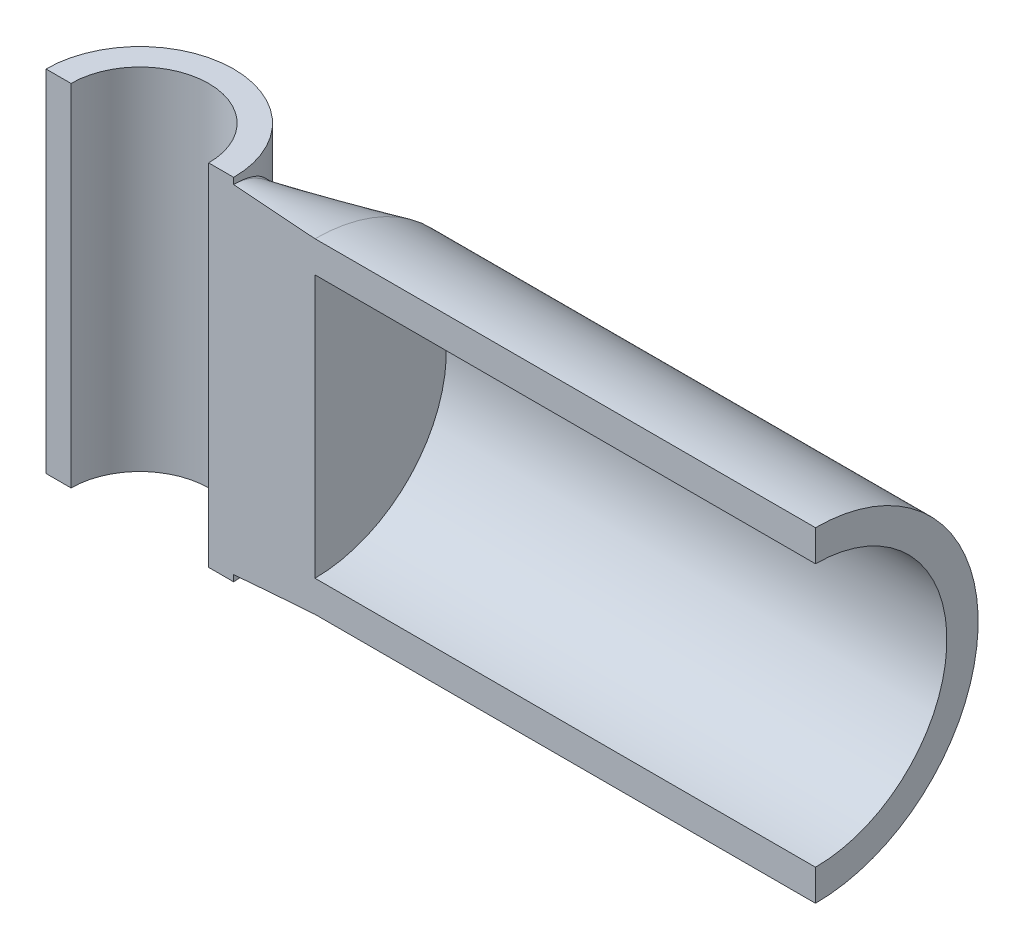
ISO-10303-21;
HEADER;
FILE_DESCRIPTION(('STEP AP214'),'2;1');
FILE_NAME('part.step','',(''),(''),'','','');
FILE_SCHEMA(('AUTOMOTIVE_DESIGN { 1 0 10303 214 1 1 1 1 }'));
ENDSEC;
DATA;
#1=APPLICATION_CONTEXT('core data for automotive mechanical design processes');
#2=APPLICATION_PROTOCOL_DEFINITION('international standard','automotive_design',2000,#1);
#3=PRODUCT_CONTEXT('',#1,'mechanical');
#4=PRODUCT('Part','Part','',(#3));
#5=PRODUCT_RELATED_PRODUCT_CATEGORY('part','',(#4));
#6=PRODUCT_DEFINITION_FORMATION('','',#4);
#7=PRODUCT_DEFINITION_CONTEXT('part definition',#1,'design');
#8=PRODUCT_DEFINITION('design','',#6,#7);
#9=PRODUCT_DEFINITION_SHAPE('','',#8);
#10=(LENGTH_UNIT() NAMED_UNIT(*) SI_UNIT(.MILLI.,.METRE.));
#11=(NAMED_UNIT(*) PLANE_ANGLE_UNIT() SI_UNIT($,.RADIAN.));
#12=(NAMED_UNIT(*) SI_UNIT($,.STERADIAN.) SOLID_ANGLE_UNIT());
#13=UNCERTAINTY_MEASURE_WITH_UNIT(LENGTH_MEASURE(1.E-05),#10,'distance_accuracy_value','');
#14=(GEOMETRIC_REPRESENTATION_CONTEXT(3) GLOBAL_UNCERTAINTY_ASSIGNED_CONTEXT((#13)) GLOBAL_UNIT_ASSIGNED_CONTEXT((#10,
#11,#12)) REPRESENTATION_CONTEXT('',''));
#15=CARTESIAN_POINT('',(0.,0.,0.));
#16=DIRECTION('',(0.,0.,1.));
#17=DIRECTION('',(1.,0.,0.));
#18=AXIS2_PLACEMENT_3D('',#15,#16,#17);
#19=CARTESIAN_POINT('',(0.,-17.78,0.));
#20=DIRECTION('',(0.,1.,0.));
#21=DIRECTION('',(0.,0.,1.));
#22=AXIS2_PLACEMENT_3D('',#19,#20,#21);
#23=CYLINDRICAL_SURFACE('',#22,9.525);
#24=DIRECTION('',(0.,1.,0.));
#25=VECTOR('',#24,1.);
#26=CARTESIAN_POINT('',(9.525,-17.78,0.));
#27=LINE('',#26,#25);
#28=CARTESIAN_POINT('',(9.525,-17.78,0.));
#29=VERTEX_POINT('',#28);
#30=CARTESIAN_POINT('',(9.525,-17.145,0.));
#31=VERTEX_POINT('',#30);
#32=EDGE_CURVE('E143',#29,#31,#27,.T.);
#33=ORIENTED_EDGE('',*,*,#32,.F.);
#34=CARTESIAN_POINT('',(0.,-17.78,0.));
#35=DIRECTION('',(0.,1.,0.));
#36=DIRECTION('',(0.,0.,1.));
#37=AXIS2_PLACEMENT_3D('',#34,#35,#36);
#38=CIRCLE('',#37,9.525);
#39=CARTESIAN_POINT('',(-9.52500000000001,-17.78,0.));
#40=VERTEX_POINT('',#39);
#41=EDGE_CURVE('E12',#29,#40,#38,.T.);
#42=ORIENTED_EDGE('',*,*,#41,.T.);
#43=DIRECTION('',(0.,1.,0.));
#44=VECTOR('',#43,1.);
#45=CARTESIAN_POINT('',(-9.52500000000001,43.1115148036341,0.));
#46=LINE('',#45,#44);
#47=CARTESIAN_POINT('',(-9.52500000000001,17.78,0.));
#48=VERTEX_POINT('',#47);
#49=EDGE_CURVE('E123',#40,#48,#46,.T.);
#50=ORIENTED_EDGE('',*,*,#49,.T.);
#51=CARTESIAN_POINT('',(0.,17.78,0.));
#52=DIRECTION('',(0.,1.,0.));
#53=DIRECTION('',(0.,0.,1.));
#54=AXIS2_PLACEMENT_3D('',#51,#52,#53);
#55=CIRCLE('',#54,9.525);
#56=CARTESIAN_POINT('',(9.525,17.78,0.));
#57=VERTEX_POINT('',#56);
#58=EDGE_CURVE('E332',#57,#48,#55,.T.);
#59=ORIENTED_EDGE('',*,*,#58,.F.);
#60=CARTESIAN_POINT('',(9.525,17.145,0.));
#61=VERTEX_POINT('',#60);
#62=EDGE_CURVE('E161',#61,#57,#27,.T.);
#63=ORIENTED_EDGE('',*,*,#62,.F.);
#64=CARTESIAN_POINT('',(9.525,-17.145,0.));
#65=CARTESIAN_POINT('',(9.52500068532762,-17.145001391133,0.128318924390924));
#66=CARTESIAN_POINT('',(9.5224009262164,-17.1396297825695,0.256628554292851));
#67=CARTESIAN_POINT('',(9.5120792277361,-17.1182992131656,0.512179138446968));
#68=CARTESIAN_POINT('',(9.50435632573581,-17.1023382626029,0.639419887306983));
#69=CARTESIAN_POINT('',(9.48410085409511,-17.0604636695596,0.890611239276342));
#70=CARTESIAN_POINT('',(9.47161420334114,-17.034645045696,1.0145815314022));
#71=CARTESIAN_POINT('',(9.44214149324302,-16.9736795479713,1.25969757564131));
#72=CARTESIAN_POINT('',(9.42515355723253,-16.9385287833618,1.3808421266787));
#73=CARTESIAN_POINT('',(9.3870311759982,-16.8596067877553,1.6198587262884));
#74=CARTESIAN_POINT('',(9.36588924392186,-16.8158199912686,1.73772442083015));
#75=CARTESIAN_POINT('',(9.31989459155717,-16.7205021081437,1.96956333119229));
#76=CARTESIAN_POINT('',(9.29503978212747,-16.6689666614307,2.08353431090623));
#77=CARTESIAN_POINT('',(9.19066169316927,-16.4523861308366,2.52416312253578));
#78=CARTESIAN_POINT('',(9.09849732371152,-16.2608266117642,2.83519485805657));
#79=CARTESIAN_POINT('',(8.94613047122778,-15.9431356332896,3.27360698917579));
#80=CARTESIAN_POINT('',(8.89290974054206,-15.8320157704412,3.41522080046828));
#81=CARTESIAN_POINT('',(8.7825587546782,-15.60121887365,3.68972912880236));
#82=CARTESIAN_POINT('',(8.72542917264761,-15.4815433129348,3.82262513946327));
#83=CARTESIAN_POINT('',(8.56516651194081,-15.1451751650685,4.17416065215533));
#84=CARTESIAN_POINT('',(8.45888795696625,-14.9214201350951,4.38459368894503));
#85=CARTESIAN_POINT('',(8.23997681272182,-14.4586413712805,4.78330768287632));
#86=CARTESIAN_POINT('',(8.12735180396737,-14.2196358100598,4.97161427254834));
#87=CARTESIAN_POINT('',(7.92424373363755,-13.7865002890836,5.28758772194248));
#88=CARTESIAN_POINT('',(7.83467091520297,-13.5947910791499,5.41920066085862));
#89=CARTESIAN_POINT('',(7.65357669807196,-13.2055325178248,5.67208807722901));
#90=CARTESIAN_POINT('',(7.56205500936725,-13.0079822955182,5.79336100237503));
#91=CARTESIAN_POINT('',(7.37759164622964,-12.60784198134,6.02651453904034));
#92=CARTESIAN_POINT('',(7.28464891776934,-12.4052480707042,6.13838773486383));
#93=CARTESIAN_POINT('',(7.09790498798253,-11.9958495483696,6.35339529022642));
#94=CARTESIAN_POINT('',(7.00410368316967,-11.7890444253036,6.45652858053565));
#95=CARTESIAN_POINT('',(6.72271525213335,-11.1645474627312,6.75314410303598));
#96=CARTESIAN_POINT('',(6.53450684035862,-10.7413982630866,6.93462935852449));
#97=CARTESIAN_POINT('',(6.15983672877069,-9.88370242338699,7.26945953927172));
#98=CARTESIAN_POINT('',(5.97337449486899,-9.44915943377956,7.42281335461494));
#99=CARTESIAN_POINT('',(5.60556999017795,-8.57012396264579,7.70433259890339));
#100=CARTESIAN_POINT('',(5.42422528330919,-8.12563640203105,7.83251019170726));
#101=CARTESIAN_POINT('',(5.15920212973809,-7.45176511512828,8.00746328472295));
#102=CARTESIAN_POINT('',(5.0720286654547,-7.22595666827723,8.06289435092908));
#103=CARTESIAN_POINT('',(4.90068086481704,-6.77191652771398,8.16817353221226));
#104=CARTESIAN_POINT('',(4.81650637947811,-6.54368495511213,8.2180219248924));
#105=CARTESIAN_POINT('',(4.65331817546855,-6.08860206670355,8.31149486964881));
#106=CARTESIAN_POINT('',(4.57424154002776,-5.86179190673089,8.35520986097442));
#107=CARTESIAN_POINT('',(4.42064071901423,-5.40572171638403,8.43748477527195));
#108=CARTESIAN_POINT('',(4.3461161849194,-5.17646187514761,8.47604509316996));
#109=CARTESIAN_POINT('',(4.20257824520052,-4.71507484729298,8.5481237132971));
#110=CARTESIAN_POINT('',(4.13357255795847,-4.48294415164354,8.58163501013761));
#111=CARTESIAN_POINT('',(4.00242661876834,-4.0159930322244,8.6435795719034));
#112=CARTESIAN_POINT('',(3.94028841962187,-3.78117182724394,8.67201132002796));
#113=CARTESIAN_POINT('',(3.81941641663787,-3.2888254737887,8.72596299724267));
#114=CARTESIAN_POINT('',(3.76142101745402,-3.03106717508945,8.75102995655326));
#115=CARTESIAN_POINT('',(3.65726262264106,-2.51261699890337,8.79507026682276));
#116=CARTESIAN_POINT('',(3.61110001457123,-2.25192502562178,8.81404341819639));
#117=CARTESIAN_POINT('',(3.5326394673394,-1.72809404489128,8.84578348388008));
#118=CARTESIAN_POINT('',(3.50033951409106,-1.46495539859572,8.85855129979062));
#119=CARTESIAN_POINT('',(3.45136274729835,-0.937695190567448,8.87774864178427));
#120=CARTESIAN_POINT('',(3.43464367626872,-0.673578249406205,8.88419531416838));
#121=CARTESIAN_POINT('',(3.41766410889622,-0.144695270853171,8.89074147948595));
#122=CARTESIAN_POINT('',(3.4174056379631,0.120070842408317,8.89084019132875));
#123=CARTESIAN_POINT('',(3.43336733820953,0.64891995214639,8.88468820112375));
#124=CARTESIAN_POINT('',(3.44958092856971,0.91300317920394,8.87844003474292));
#125=CARTESIAN_POINT('',(3.49480743974223,1.40982764820113,8.86072518835086));
#126=CARTESIAN_POINT('',(3.52217198030299,1.64274699896151,8.84992597937348));
#127=CARTESIAN_POINT('',(3.58794836012964,2.10668119173421,8.82346330355366));
#128=CARTESIAN_POINT('',(3.62635810617586,2.33769638608535,8.80780075833606));
#129=CARTESIAN_POINT('',(3.71290850872054,2.79778713627379,8.77166639925035));
#130=CARTESIAN_POINT('',(3.76106086356882,3.02686001205556,8.75118879890885));
#131=CARTESIAN_POINT('',(3.86564712000471,3.48262558328914,8.70549546050952));
#132=CARTESIAN_POINT('',(3.92208142858039,3.70931816118244,8.68027948958371));
#133=CARTESIAN_POINT('',(4.04164576414931,4.15935984530206,8.62525573132132));
#134=CARTESIAN_POINT('',(4.10474778928547,4.38271876551774,8.59546692664209));
#135=CARTESIAN_POINT('',(4.23665034230459,4.82705748807755,8.5312250251126));
#136=CARTESIAN_POINT('',(4.30545079358716,5.04803732235714,8.4967719909567));
#137=CARTESIAN_POINT('',(4.44768492938279,5.48755704831037,8.42319003673368));
#138=CARTESIAN_POINT('',(4.52111574574837,5.70609835360723,8.38406399805364));
#139=CARTESIAN_POINT('',(4.67179042200664,6.14095500311337,8.30104841371898));
#140=CARTESIAN_POINT('',(4.74903450462357,6.3572702164078,8.25715858964253));
#141=CARTESIAN_POINT('',(4.98522637552608,7.00260266356583,8.11827870367561));
#142=CARTESIAN_POINT('',(5.14876483467966,7.4284027395866,8.01601220322391));
#143=CARTESIAN_POINT('',(5.48352097620169,8.27156666635244,7.7908533456527));
#144=CARTESIAN_POINT('',(5.65474084411357,8.68892806646187,7.6679550906845));
#145=CARTESIAN_POINT('',(6.00153540489677,9.51485304871765,7.39968321307842));
#146=CARTESIAN_POINT('',(6.17711248123866,9.9234115766217,7.25429705102171));
#147=CARTESIAN_POINT('',(6.52959256103232,10.729981493898,6.93873458053696));
#148=CARTESIAN_POINT('',(6.7064945896787,11.1279998152068,6.76857506861832));
#149=CARTESIAN_POINT('',(7.02080010398045,11.8264573623029,6.44001881942489));
#150=CARTESIAN_POINT('',(7.15845225121188,12.1293443241387,6.28706950901455));
#151=CARTESIAN_POINT('',(7.43179718456903,12.7261392115118,5.9614863931751));
#152=CARTESIAN_POINT('',(7.56748632110351,13.0200313239349,5.78882019225024));
#153=CARTESIAN_POINT('',(7.80473711640115,13.5306879180504,5.46284147415894));
#154=CARTESIAN_POINT('',(7.90709386256605,13.749898489035,5.31394662006122));
#155=CARTESIAN_POINT('',(8.10839487006017,14.1792371594905,5.00141186388438));
#156=CARTESIAN_POINT('',(8.20733945831557,14.3893661295804,4.83777337988197));
#157=CARTESIAN_POINT('',(8.40023989721174,14.7976106817961,4.49447222936413));
#158=CARTESIAN_POINT('',(8.49420752403327,14.9957547956271,4.31485035665488));
#159=CARTESIAN_POINT('',(8.6757551288211,15.3774707136437,3.93711198806145));
#160=CARTESIAN_POINT('',(8.76332895070525,15.5610284884576,3.73897807607258));
#161=CARTESIAN_POINT('',(8.89160552736648,15.829270156124,3.41757581620205));
#162=CARTESIAN_POINT('',(8.93548199582827,15.9208935732083,3.30133503678769));
#163=CARTESIAN_POINT('',(9.02008180610424,16.0973519413748,3.06264395099305));
#164=CARTESIAN_POINT('',(9.06080464750314,16.1821858151683,2.94019266421478));
#165=CARTESIAN_POINT('',(9.1384236011794,16.3437192962771,2.68924702733705));
#166=CARTESIAN_POINT('',(9.17532767056684,16.4204358254046,2.56076608821909));
#167=CARTESIAN_POINT('',(9.24473317147388,16.5645940736278,2.29761415539768));
#168=CARTESIAN_POINT('',(9.27723704821432,16.6320409442638,2.1629466558064));
#169=CARTESIAN_POINT('',(9.33227760971739,16.746173253562,1.91001132046374));
#170=CARTESIAN_POINT('',(9.35557578301703,16.7944516492553,1.79262879199519));
#171=CARTESIAN_POINT('',(9.39814370021262,16.8826188413012,1.55408684479454));
#172=CARTESIAN_POINT('',(9.41741539544697,16.9225117015645,1.432929288409));
#173=CARTESIAN_POINT('',(9.45150970845768,16.993062425965,1.18740760476302));
#174=CARTESIAN_POINT('',(9.46633505532803,17.0237259549523,1.06304549552043));
#175=CARTESIAN_POINT('',(9.49118260905065,17.0751063235551,0.811794232204127));
#176=CARTESIAN_POINT('',(9.50120474758437,17.0958230216918,0.684905042213164));
#177=CARTESIAN_POINT('',(9.51621459024575,17.1268461570292,0.428765599009137));
#178=CARTESIAN_POINT('',(9.52117118139144,17.1370882587189,0.299505660130364));
#179=CARTESIAN_POINT('',(9.52579461647629,17.1466420150261,0.0404853616133317));
#180=CARTESIAN_POINT('',(9.52546148409152,17.1459537185666,-0.089274995782525));
#181=CARTESIAN_POINT('',(9.5195150926699,17.1336660461635,-0.348180364393133));
#182=CARTESIAN_POINT('',(9.51390066448669,17.1220642542459,-0.477325232991475));
#183=CARTESIAN_POINT('',(9.49755565288517,17.0882799627324,-0.733884365959778));
#184=CARTESIAN_POINT('',(9.4868251462493,17.06609762193,-0.861298656272853));
#185=CARTESIAN_POINT('',(9.46172434607469,17.0141894175261,-1.10214228125246));
#186=CARTESIAN_POINT('',(9.44776675165013,16.9853184231682,-1.2158010842582));
#187=CARTESIAN_POINT('',(9.41614674550098,16.9198850739686,-1.44037428269834));
#188=CARTESIAN_POINT('',(9.39848317278917,16.883320308857,-1.55128780590563));
#189=CARTESIAN_POINT('',(9.34042885280883,16.7630821824071,-1.87915265871484));
#190=CARTESIAN_POINT('',(9.29495967787159,16.6688343724019,-2.09136458695062));
#191=CARTESIAN_POINT('',(9.16076373245886,16.3902658450272,-2.6316645253732));
#192=CARTESIAN_POINT('',(9.06292060689757,16.1867885243535,-2.94757518485465));
#193=CARTESIAN_POINT('',(8.90185432825655,15.8506965851272,-3.39229038027132));
#194=CARTESIAN_POINT('',(8.84565141183374,15.7332460833386,-3.5359357996142));
#195=CARTESIAN_POINT('',(8.72933348979714,15.4897234375088,-3.81405778731643));
#196=CARTESIAN_POINT('',(8.66921925783922,15.3636529982367,-3.94853615820166));
#197=CARTESIAN_POINT('',(8.49858348055318,15.0050567378641,-4.30866397905967));
#198=CARTESIAN_POINT('',(8.38473389998818,14.7649827613238,-4.52521258264479));
#199=CARTESIAN_POINT('',(8.15037095834782,14.2685435195765,-4.93485122667267));
#200=CARTESIAN_POINT('',(8.02985199053893,14.0121645194058,-5.12792107963171));
#201=CARTESIAN_POINT('',(7.78431171729574,13.4869698072339,-5.49350661225298));
#202=CARTESIAN_POINT('',(7.65928707737101,13.2181448407125,-5.6660066445241));
#203=CARTESIAN_POINT('',(7.4065172139052,12.6710398908665,-5.99263997850955));
#204=CARTESIAN_POINT('',(7.27877304637783,12.3927635534635,-6.14678026147307));
#205=CARTESIAN_POINT('',(7.0070377804108,11.796039981134,-6.45554528552448));
#206=CARTESIAN_POINT('',(6.86286747141867,11.476652880018,-6.60818784675144));
#207=CARTESIAN_POINT('',(6.57445024703752,10.8304591049161,-6.89518183215504));
#208=CARTESIAN_POINT('',(6.43020370221977,10.5036631074982,-7.02955783962044));
#209=CARTESIAN_POINT('',(6.14288509298687,9.84331037887629,-7.28197380957341));
#210=CARTESIAN_POINT('',(5.99981311842168,9.50975313711106,-7.40001253307726));
#211=CARTESIAN_POINT('',(5.71639085798055,8.83656102104636,-7.62107479049304));
#212=CARTESIAN_POINT('',(5.57604064395353,8.49692598675939,-7.72409792849066));
#213=CARTESIAN_POINT('',(5.32930039438936,7.88491604250184,-7.89567556898984));
#214=CARTESIAN_POINT('',(5.22204709703272,7.6136317424831,-7.96689684623387));
#215=CARTESIAN_POINT('',(5.01140815812671,7.06753594738078,-8.10104930568151));
#216=CARTESIAN_POINT('',(4.90802243264331,6.79272452901675,-8.16398066786763));
#217=CARTESIAN_POINT('',(4.70614285273823,6.23877892194716,-8.28200139270145));
#218=CARTESIAN_POINT('',(4.60766267689167,5.95963521351296,-8.33706954851112));
#219=CARTESIAN_POINT('',(4.41748278537656,5.39753028511907,-8.43937969988608));
#220=CARTESIAN_POINT('',(4.3257848746463,5.11456807247692,-8.48661961627147));
#221=CARTESIAN_POINT('',(4.14953974847229,4.53928197293902,-8.57419443035667));
#222=CARTESIAN_POINT('',(4.06516310184918,4.24688257932757,-8.61437976866151));
#223=CARTESIAN_POINT('',(3.90817673322144,3.65791933358065,-8.68672863151387));
#224=CARTESIAN_POINT('',(3.83556718401748,3.36135542035841,-8.71889203826249));
#225=CARTESIAN_POINT('',(3.70514007807645,2.76414873233187,-8.77511362054172));
#226=CARTESIAN_POINT('',(3.64732406413697,2.46350553554472,-8.79917095078349));
#227=CARTESIAN_POINT('',(3.54994491308521,1.86035923829884,-8.83890771723432));
#228=CARTESIAN_POINT('',(3.51028398267441,1.55787521361515,-8.85463211332396));
#229=CARTESIAN_POINT('',(3.45146202437025,0.950607994761538,-8.87772792495739));
#230=CARTESIAN_POINT('',(3.43229782969967,0.645825163090767,-8.88510063086057));
#231=CARTESIAN_POINT('',(3.41598842825677,0.035822517433288,-8.89138595377053));
#232=CARTESIAN_POINT('',(3.41882348617108,-0.269396659362656,-8.89030615342999));
#233=CARTESIAN_POINT('',(3.44160527750243,-0.776511097816434,-8.88149960081635));
#234=CARTESIAN_POINT('',(3.4554978201446,-0.978747399692027,-8.87612215957019));
#235=CARTESIAN_POINT('',(3.49236414300072,-1.38222567224812,-8.86168249993286));
#236=CARTESIAN_POINT('',(3.51533640764344,-1.5834678032007,-8.85262089648834));
#237=CARTESIAN_POINT('',(3.56968842016194,-1.98489847510913,-8.83084378592175));
#238=CARTESIAN_POINT('',(3.60108024461458,-2.18508507818492,-8.81812302838514));
#239=CARTESIAN_POINT('',(3.67138820401819,-2.58386977587345,-8.78908295846825));
#240=CARTESIAN_POINT('',(3.71030487477605,-2.782467756319,-8.7727633898229));
#241=CARTESIAN_POINT('',(3.81750022291542,-3.28450444793394,-8.72681541256209));
#242=CARTESIAN_POINT('',(3.89029929930663,-3.58675879203809,-8.69475458475053));
#243=CARTESIAN_POINT('',(4.04832340351057,-4.18699433297393,-8.62231126312558));
#244=CARTESIAN_POINT('',(4.13355085619262,-4.48497468342753,-8.58192714473882));
#245=CARTESIAN_POINT('',(4.31368424385293,-5.07686628510665,-8.49281206756384));
#246=CARTESIAN_POINT('',(4.40859472017993,-5.37077555291603,-8.44407718490922));
#247=CARTESIAN_POINT('',(4.60578114849325,-5.95453290985261,-8.33816127418112));
#248=CARTESIAN_POINT('',(4.70805658930415,-6.24438127916717,-8.28098083199424));
#249=CARTESIAN_POINT('',(4.9179098293706,-6.81948450093699,-8.15809671414647));
#250=CARTESIAN_POINT('',(5.02547405171538,-7.10474885249849,-8.09241422149752));
#251=CARTESIAN_POINT('',(5.24470011737063,-7.67147880992567,-7.95208709630282));
#252=CARTESIAN_POINT('',(5.35636205923489,-7.95294432420295,-7.87744224810622));
#253=CARTESIAN_POINT('',(5.58249308308317,-8.51173112698692,-7.71883769879021));
#254=CARTESIAN_POINT('',(5.6969590628899,-8.78905649345315,-7.63488795885056));
#255=CARTESIAN_POINT('',(5.92782495202355,-9.33966915803567,-7.45706011310777));
#256=CARTESIAN_POINT('',(6.04422475760124,-9.61295667130499,-7.36318253848972));
#257=CARTESIAN_POINT('',(6.32549794444124,-10.2650819446248,-7.12461730903962));
#258=CARTESIAN_POINT('',(6.49090151993087,-10.6418185001755,-6.97475486826997));
#259=CARTESIAN_POINT('',(6.82192926509456,-11.3859258292458,-6.65136111844689));
#260=CARTESIAN_POINT('',(6.98755329668921,-11.7532785454484,-6.47778773783633));
#261=CARTESIAN_POINT('',(7.27867729702902,-12.3925330628166,-6.14680893705535));
#262=CARTESIAN_POINT('',(7.40467070997583,-12.6670094713756,-5.99482020245371));
#263=CARTESIAN_POINT('',(7.6540242942934,-13.20678669742,-5.67300756424842));
#264=CARTESIAN_POINT('',(7.77738351354982,-13.47208421804,-5.50317733896947));
#265=CARTESIAN_POINT('',(8.01954036339472,-13.9901705109664,-5.14387371794983));
#266=CARTESIAN_POINT('',(8.13834867773017,-14.2429890409664,-4.95445075544966));
#267=CARTESIAN_POINT('',(8.36958930766592,-14.7329810486803,-4.55294023471459));
#268=CARTESIAN_POINT('',(8.48202706813321,-14.9701679158524,-4.34087249211352));
#269=CARTESIAN_POINT('',(8.64187388651503,-15.3062210807961,-4.00725658027282));
#270=CARTESIAN_POINT('',(8.69285555026459,-15.4132144943236,-3.89557772613855));
#271=CARTESIAN_POINT('',(8.79220484026982,-15.6214032465473,-3.66584827328391));
#272=CARTESIAN_POINT('',(8.84057218118049,-15.7225979524053,-3.54779698183157));
#273=CARTESIAN_POINT('',(8.98111566426173,-16.0162528152347,-3.1832442623615));
#274=CARTESIAN_POINT('',(9.06868908418739,-16.1986909512834,-2.92643387132115));
#275=CARTESIAN_POINT('',(9.18719401624621,-16.4451027480404,-2.51824512447887));
#276=CARTESIAN_POINT('',(9.22478732412524,-16.5231834078362,-2.37719689957071));
#277=CARTESIAN_POINT('',(9.29452622181883,-16.6679104385617,-2.08794876250816));
#278=CARTESIAN_POINT('',(9.32667096126725,-16.7345550246665,-1.93974773863442));
#279=CARTESIAN_POINT('',(9.38446986090003,-16.8543106324185,-1.63736135884856));
#280=CARTESIAN_POINT('',(9.41014727363139,-16.9074701432253,-1.48319980906615));
#281=CARTESIAN_POINT('',(9.4542470875884,-16.99872843479,-1.1695582748093));
#282=CARTESIAN_POINT('',(9.47267580258039,-17.0368403224503,-1.0100830505952));
#283=CARTESIAN_POINT('',(9.49959704582709,-17.0925013278238,-0.709172058197316));
#284=CARTESIAN_POINT('',(9.50909570650498,-17.1121330947042,-0.568210482630604));
#285=CARTESIAN_POINT('',(9.52179561950566,-17.1383792118163,-0.284828409657496));
#286=CARTESIAN_POINT('',(9.52499923942267,-17.1449984561191,-0.142408481010841));
#287=CARTESIAN_POINT('',(9.525,-17.145,0.));
#288=B_SPLINE_CURVE_WITH_KNOTS('',3,(#64,#65,#66,#67,#68,#69,#70,#71,#72,#73,#74,#75,#76,#77,
#78,#79,#80,#81,#82,#83,#84,#85,#86,#87,#88,#89,#90,#91,#92,#93,#94,#95,#96,#97,#98,#99,#100,
#101,#102,#103,#104,#105,#106,#107,#108,#109,#110,#111,#112,#113,#114,#115,#116,#117,#118,#119,
#120,#121,#122,#123,#124,#125,#126,#127,#128,#129,#130,#131,#132,#133,#134,#135,#136,#137,#138,
#139,#140,#141,#142,#143,#144,#145,#146,#147,#148,#149,#150,#151,#152,#153,#154,#155,#156,#157,
#158,#159,#160,#161,#162,#163,#164,#165,#166,#167,#168,#169,#170,#171,#172,#173,#174,#175,#176,
#177,#178,#179,#180,#181,#182,#183,#184,#185,#186,#187,#188,#189,#190,#191,#192,#193,#194,#195,
#196,#197,#198,#199,#200,#201,#202,#203,#204,#205,#206,#207,#208,#209,#210,#211,#212,#213,#214,
#215,#216,#217,#218,#219,#220,#221,#222,#223,#224,#225,#226,#227,#228,#229,#230,#231,#232,#233,
#234,#235,#236,#237,#238,#239,#240,#241,#242,#243,#244,#245,#246,#247,#248,#249,#250,#251,#252,
#253,#254,#255,#256,#257,#258,#259,#260,#261,#262,#263,#264,#265,#266,#267,#268,#269,#270,#271,
#272,#273,#274,#275,#276,#277,#278,#279,#280,#281,#282,#283,#284,#285,#286,#287),.UNSPECIFIED.,
.T.,.F.,(4,2,2,2,2,2,2,2,2,2,2,2,2,2,2,2,2,2,2,2,2,2,2,2,2,2,2,2,2,2,2,2,2,2,2,2,2,2,2,2,2,2,2,
2,2,2,2,2,2,2,2,2,2,2,2,2,2,2,2,2,2,2,2,2,2,2,2,2,2,2,2,2,2,2,2,2,2,2,2,2,2,2,2,2,2,2,2,2,2,2,2,
2,2,2,2,2,2,2,2,2,2,2,2,2,2,2,2,2,2,2,2,4),(0.,0.384804366523112,0.769681057724254,
1.15093791835735,1.53235398258471,1.91446389504051,2.29678962653608,3.41965514839574,
3.98255305269532,4.54535426253948,5.5188908189974,6.49128821816948,7.23856666539762,
7.98595710197965,8.73393174401188,9.48199776068552,10.973017463361,12.4635651598891,
13.9533909191829,14.6982693355021,15.4431106956624,16.175447244597,16.9077276532589,
17.641014906795,18.3745207621016,19.1703789507176,19.9662632027377,20.7620317826363,
21.5556357940439,22.3493374550021,23.1427221456693,23.8466942045373,24.5505329387588,
25.2552218707341,25.9599454438215,26.6618189720333,27.3636830669296,28.0651166033726,
28.7665911575455,30.1682748441499,31.570359904248,32.9732296143875,34.3751525604545,
35.473144982202,36.572968127907,37.4247473411366,38.2764447155348,39.1260274830549,
39.9764177436499,40.4392946186258,40.9022447927115,41.3642100319537,41.8259174904072,
42.2126956257277,42.5992858810493,42.9856383658585,43.3719963457982,43.7607133577163,
44.1494286297919,44.5382299739307,44.9270254830983,45.2809550058639,45.6349955715999,
46.3426594298867,47.5005612666438,48.0819109922545,48.6631460747726,49.6897686284852,
50.717267742871,51.7455435524302,52.7734271059217,53.9194992563613,55.0640134109518,
56.2086143154772,57.3532453941128,58.2539501436169,59.154635334676,60.0577055351162,
60.9610152078402,61.8816237113883,62.8022457329126,63.7229637257543,64.63866211275,
65.554219002489,66.4689546501528,67.0770799173442,67.6851037201735,68.2940043482681,
68.9029483491264,69.8400944204212,70.7774235811801,71.715194389065,72.6529001723045,
73.588313064642,74.5237484692552,75.4581919603376,76.3925854796412,77.7055944196891,
79.0209641161971,80.0347657332102,81.0489277842119,82.0605413723215,83.0712768776845,
83.5595833550071,84.0479430222455,85.0250697294623,85.5211971419875,86.0174019146992,
86.511796318807,87.0057591364307,87.4329761474894,87.8600324494574),.UNSPECIFIED.);
#289=EDGE_CURVE('E145',#61,#31,#288,.T.);
#290=ORIENTED_EDGE('',*,*,#289,.T.);
#291=EDGE_LOOP('',(#33,#42,#50,#59,#63,#290));
#292=FACE_BOUND('',#291,.T.);
#293=ADVANCED_FACE('F41',(#292),#23,.T.);
#294=CARTESIAN_POINT('',(0.,-17.78,0.));
#295=DIRECTION('',(0.,1.,0.));
#296=DIRECTION('',(0.,0.,1.));
#297=AXIS2_PLACEMENT_3D('',#294,#295,#296);
#298=PLANE('',#297);
#299=ORIENTED_EDGE('',*,*,#41,.F.);
#300=DIRECTION('',(-1.,0.,0.));
#301=VECTOR('',#300,1.);
#302=CARTESIAN_POINT('',(0.,-17.78,0.));
#303=LINE('',#302,#301);
#304=CARTESIAN_POINT('',(6.985,-17.78,0.));
#305=VERTEX_POINT('',#304);
#306=EDGE_CURVE('E140',#29,#305,#303,.T.);
#307=ORIENTED_EDGE('',*,*,#306,.T.);
#308=CARTESIAN_POINT('',(0.,-17.78,0.));
#309=DIRECTION('',(0.,1.,0.));
#310=DIRECTION('',(0.,0.,1.));
#311=AXIS2_PLACEMENT_3D('',#308,#309,#310);
#312=CIRCLE('',#311,6.985);
#313=CARTESIAN_POINT('',(-6.985,-17.78,0.));
#314=VERTEX_POINT('',#313);
#315=EDGE_CURVE('E50',#305,#314,#312,.T.);
#316=ORIENTED_EDGE('',*,*,#315,.T.);
#317=EDGE_CURVE('E126',#314,#40,#303,.T.);
#318=ORIENTED_EDGE('',*,*,#317,.T.);
#319=EDGE_LOOP('',(#299,#307,#316,#318));
#320=FACE_BOUND('',#319,.T.);
#321=ADVANCED_FACE('F136',(#320),#298,.F.);
#322=CARTESIAN_POINT('',(0.,-17.78,0.));
#323=DIRECTION('',(0.,1.,0.));
#324=DIRECTION('',(0.,0.,1.));
#325=AXIS2_PLACEMENT_3D('',#322,#323,#324);
#326=CYLINDRICAL_SURFACE('',#325,6.985);
#327=CARTESIAN_POINT('',(0.,17.78,0.));
#328=DIRECTION('',(0.,1.,0.));
#329=DIRECTION('',(0.,0.,1.));
#330=AXIS2_PLACEMENT_3D('',#327,#328,#329);
#331=CIRCLE('',#330,6.985);
#332=CARTESIAN_POINT('',(6.985,17.78,0.));
#333=VERTEX_POINT('',#332);
#334=CARTESIAN_POINT('',(-6.985,17.78,0.));
#335=VERTEX_POINT('',#334);
#336=EDGE_CURVE('E239',#333,#335,#331,.T.);
#337=ORIENTED_EDGE('',*,*,#336,.T.);
#338=DIRECTION('',(0.,1.,0.));
#339=VECTOR('',#338,1.);
#340=CARTESIAN_POINT('',(-6.985,-17.78,0.));
#341=LINE('',#340,#339);
#342=EDGE_CURVE('E58',#335,#314,#341,.F.);
#343=ORIENTED_EDGE('',*,*,#342,.T.);
#344=ORIENTED_EDGE('',*,*,#315,.F.);
#345=DIRECTION('',(0.,1.,0.));
#346=VECTOR('',#345,1.);
#347=CARTESIAN_POINT('',(6.985,-17.78,0.));
#348=LINE('',#347,#346);
#349=EDGE_CURVE('E330',#305,#333,#348,.T.);
#350=ORIENTED_EDGE('',*,*,#349,.T.);
#351=EDGE_LOOP('',(#337,#343,#344,#350));
#352=FACE_BOUND('',#351,.T.);
#353=ADVANCED_FACE('F318',(#352),#326,.F.);
#354=CARTESIAN_POINT('',(0.,17.78,0.));
#355=DIRECTION('',(0.,1.,0.));
#356=DIRECTION('',(0.,0.,1.));
#357=AXIS2_PLACEMENT_3D('',#354,#355,#356);
#358=PLANE('',#357);
#359=DIRECTION('',(-1.,0.,0.));
#360=VECTOR('',#359,1.);
#361=CARTESIAN_POINT('',(0.,17.78,0.));
#362=LINE('',#361,#360);
#363=EDGE_CURVE('E165',#57,#333,#362,.T.);
#364=ORIENTED_EDGE('',*,*,#363,.F.);
#365=ORIENTED_EDGE('',*,*,#58,.T.);
#366=EDGE_CURVE('E127',#335,#48,#362,.T.);
#367=ORIENTED_EDGE('',*,*,#366,.F.);
#368=ORIENTED_EDGE('',*,*,#336,.F.);
#369=EDGE_LOOP('',(#364,#365,#367,#368));
#370=FACE_BOUND('',#369,.T.);
#371=ADVANCED_FACE('F248',(#370),#358,.T.);
#372=CARTESIAN_POINT('',(-9.526,0.,0.));
#373=DIRECTION('',(1.,0.,0.));
#374=DIRECTION('',(0.,-1.,0.));
#375=AXIS2_PLACEMENT_3D('',#372,#373,#374);
#376=ELLIPSE('',#375,17.145,8.89);
#377=DIRECTION('',(1.,0.,0.));
#378=VECTOR('',#377,1.);
#379=SURFACE_OF_LINEAR_EXTRUSION('',#376,#378);
#380=ORIENTED_EDGE('',*,*,#289,.F.);
#381=CARTESIAN_POINT('',(9.525,12.8035000905406,-5.91250754467299));
#382=CARTESIAN_POINT('',(9.525,35.6088863342793,7.36519625292469));
#383=CARTESIAN_POINT('',(9.525,10.0018861531981,19.1902113422707));
#384=CARTESIAN_POINT('',(9.525,-12.8035000905406,5.91250754467299));
#385=CARTESIAN_POINT('',(9.525,-35.6088863342793,-7.36519625292468));
#386=CARTESIAN_POINT('',(9.525,-10.0018861531981,-19.1902113422707));
#387=CARTESIAN_POINT('',(9.525,12.8035000905406,-5.91250754467299));
#388=(BOUNDED_CURVE() B_SPLINE_CURVE(3,(#381,#382,#383,#384,#385,#386,#387),.UNSPECIFIED.,.T.,
.F.) B_SPLINE_CURVE_WITH_KNOTS((4,3,4),(0.,0.5,1.),
.UNSPECIFIED.) CURVE() GEOMETRIC_REPRESENTATION_ITEM() RATIONAL_B_SPLINE_CURVE((1.,
0.333333333333333,0.333333333333333,1.,0.333333333333333,0.333333333333333,1.)) REPRESENTATION_ITEM(''));
#389=CARTESIAN_POINT('',(9.525,16.8726077758818,-1.57838705019624));
#390=VERTEX_POINT('',#389);
#391=EDGE_CURVE('E66',#390,#61,#388,.T.);
#392=ORIENTED_EDGE('',*,*,#391,.F.);
#393=CARTESIAN_POINT('',(9.525,12.8035000905406,-5.91250754467299));
#394=CARTESIAN_POINT('',(9.525,35.6088863342793,7.36519625292469));
#395=CARTESIAN_POINT('',(9.525,10.0018861531981,19.1902113422707));
#396=CARTESIAN_POINT('',(9.525,-12.8035000905406,5.91250754467299));
#397=CARTESIAN_POINT('',(9.525,-35.6088863342793,-7.36519625292468));
#398=CARTESIAN_POINT('',(9.525,-10.0018861531981,-19.1902113422707));
#399=CARTESIAN_POINT('',(9.525,12.8035000905406,-5.91250754467299));
#400=(BOUNDED_CURVE() B_SPLINE_CURVE(3,(#393,#394,#395,#396,#397,#398,#399),.UNSPECIFIED.,.T.,
.F.) B_SPLINE_CURVE_WITH_KNOTS((4,3,4),(0.,0.5,1.),
.UNSPECIFIED.) CURVE() GEOMETRIC_REPRESENTATION_ITEM() RATIONAL_B_SPLINE_CURVE((1.,
0.333333333333333,0.333333333333333,1.,0.333333333333333,0.333333333333333,1.)) REPRESENTATION_ITEM(''));
#401=CARTESIAN_POINT('',(9.525,12.8035000905406,-5.91250754467299));
#402=VERTEX_POINT('',#401);
#403=EDGE_CURVE('E235',#402,#390,#400,.T.);
#404=ORIENTED_EDGE('',*,*,#403,.F.);
#405=CARTESIAN_POINT('',(9.525,12.8035000905406,-5.91250754467299));
#406=CARTESIAN_POINT('',(9.525,35.6088863342793,7.36519625292469));
#407=CARTESIAN_POINT('',(9.525,10.0018861531981,19.1902113422707));
#408=CARTESIAN_POINT('',(9.525,-12.8035000905406,5.91250754467299));
#409=CARTESIAN_POINT('',(9.525,-35.6088863342793,-7.36519625292468));
#410=CARTESIAN_POINT('',(9.525,-10.0018861531981,-19.1902113422707));
#411=CARTESIAN_POINT('',(9.525,12.8035000905406,-5.91250754467299));
#412=(BOUNDED_CURVE() B_SPLINE_CURVE(3,(#405,#406,#407,#408,#409,#410,#411),.UNSPECIFIED.,.T.,
.F.) B_SPLINE_CURVE_WITH_KNOTS((4,3,4),(0.,0.5,1.),
.UNSPECIFIED.) CURVE() GEOMETRIC_REPRESENTATION_ITEM() RATIONAL_B_SPLINE_CURVE((1.,
0.333333333333333,0.333333333333333,1.,0.333333333333333,0.333333333333333,1.)) REPRESENTATION_ITEM(''));
#413=CARTESIAN_POINT('',(9.525,-16.6007722013177,-2.22210367421809));
#414=VERTEX_POINT('',#413);
#415=EDGE_CURVE('E285',#414,#402,#412,.T.);
#416=ORIENTED_EDGE('',*,*,#415,.F.);
#417=CARTESIAN_POINT('',(9.525,12.8035000905406,-5.91250754467299));
#418=CARTESIAN_POINT('',(9.525,35.6088863342793,7.36519625292469));
#419=CARTESIAN_POINT('',(9.525,10.0018861531981,19.1902113422707));
#420=CARTESIAN_POINT('',(9.525,-12.8035000905406,5.91250754467299));
#421=CARTESIAN_POINT('',(9.525,-35.6088863342793,-7.36519625292468));
#422=CARTESIAN_POINT('',(9.525,-10.0018861531981,-19.1902113422707));
#423=CARTESIAN_POINT('',(9.525,12.8035000905406,-5.91250754467299));
#424=(BOUNDED_CURVE() B_SPLINE_CURVE(3,(#417,#418,#419,#420,#421,#422,#423),.UNSPECIFIED.,.T.,
.F.) B_SPLINE_CURVE_WITH_KNOTS((4,3,4),(0.,0.5,1.),
.UNSPECIFIED.) CURVE() GEOMETRIC_REPRESENTATION_ITEM() RATIONAL_B_SPLINE_CURVE((1.,
0.333333333333333,0.333333333333333,1.,0.333333333333333,0.333333333333333,1.)) REPRESENTATION_ITEM(''));
#425=EDGE_CURVE('E205',#31,#414,#424,.T.);
#426=ORIENTED_EDGE('',*,*,#425,.F.);
#427=EDGE_LOOP('',(#380,#392,#404,#416,#426));
#428=FACE_BOUND('',#427,.T.);
#429=ADVANCED_FACE('F242',(#428),#379,.T.);
#430=CARTESIAN_POINT('',(68.58,0.,0.));
#431=DIRECTION('',(1.,0.,0.));
#432=DIRECTION('',(0.,0.,-1.));
#433=AXIS2_PLACEMENT_3D('',#430,#431,#432);
#434=PLANE('',#433);
#435=DIRECTION('',(0.,1.,0.));
#436=VECTOR('',#435,1.);
#437=CARTESIAN_POINT('',(68.58,0.,0.));
#438=LINE('',#437,#436);
#439=CARTESIAN_POINT('',(68.58,-16.51,0.));
#440=VERTEX_POINT('',#439);
#441=CARTESIAN_POINT('',(68.58,-13.335,0.));
#442=VERTEX_POINT('',#441);
#443=EDGE_CURVE('E150',#440,#442,#438,.T.);
#444=ORIENTED_EDGE('',*,*,#443,.F.);
#445=CARTESIAN_POINT('',(68.58,0.,0.));
#446=DIRECTION('',(1.,0.,0.));
#447=DIRECTION('',(0.,0.,-1.));
#448=AXIS2_PLACEMENT_3D('',#445,#446,#447);
#449=CIRCLE('',#448,16.51);
#450=CARTESIAN_POINT('',(68.58,16.51,0.));
#451=VERTEX_POINT('',#450);
#452=EDGE_CURVE('E286',#440,#451,#449,.T.);
#453=ORIENTED_EDGE('',*,*,#452,.T.);
#454=CARTESIAN_POINT('',(68.58,13.335,0.));
#455=VERTEX_POINT('',#454);
#456=EDGE_CURVE('E155',#455,#451,#438,.T.);
#457=ORIENTED_EDGE('',*,*,#456,.F.);
#458=CARTESIAN_POINT('',(68.58,0.,0.));
#459=DIRECTION('',(1.,0.,0.));
#460=DIRECTION('',(0.,0.,-1.));
#461=AXIS2_PLACEMENT_3D('',#458,#459,#460);
#462=CIRCLE('',#461,13.335);
#463=EDGE_CURVE('E288',#442,#455,#462,.T.);
#464=ORIENTED_EDGE('',*,*,#463,.F.);
#465=EDGE_LOOP('',(#444,#453,#457,#464));
#466=FACE_BOUND('',#465,.T.);
#467=ADVANCED_FACE('F247',(#466),#434,.T.);
#468=CARTESIAN_POINT('',(68.58,0.,0.));
#469=DIRECTION('',(-1.,0.,0.));
#470=DIRECTION('',(0.,0.,1.));
#471=AXIS2_PLACEMENT_3D('',#468,#469,#470);
#472=CYLINDRICAL_SURFACE('',#471,16.51);
#473=ORIENTED_EDGE('',*,*,#452,.F.);
#474=DIRECTION('',(-1.,0.,0.));
#475=VECTOR('',#474,1.);
#476=CARTESIAN_POINT('',(68.58,-16.51,0.));
#477=LINE('',#476,#475);
#478=CARTESIAN_POINT('',(17.78,-16.51,0.));
#479=VERTEX_POINT('',#478);
#480=EDGE_CURVE('E153',#440,#479,#477,.T.);
#481=ORIENTED_EDGE('',*,*,#480,.T.);
#482=CARTESIAN_POINT('',(17.78,0.,0.));
#483=DIRECTION('',(1.,0.,0.));
#484=DIRECTION('',(0.,0.,-1.));
#485=AXIS2_PLACEMENT_3D('',#482,#483,#484);
#486=CIRCLE('',#485,16.51);
#487=CARTESIAN_POINT('',(17.78,16.51,0.));
#488=VERTEX_POINT('',#487);
#489=EDGE_CURVE('E44',#479,#488,#486,.T.);
#490=ORIENTED_EDGE('',*,*,#489,.T.);
#491=DIRECTION('',(-1.,0.,0.));
#492=VECTOR('',#491,1.);
#493=CARTESIAN_POINT('',(68.58,16.51,0.));
#494=LINE('',#493,#492);
#495=EDGE_CURVE('E334',#488,#451,#494,.F.);
#496=ORIENTED_EDGE('',*,*,#495,.T.);
#497=EDGE_LOOP('',(#473,#481,#490,#496));
#498=FACE_BOUND('',#497,.T.);
#499=ADVANCED_FACE('F296',(#498),#472,.T.);
#500=CARTESIAN_POINT('',(68.58,0.,0.));
#501=DIRECTION('',(-1.,0.,0.));
#502=DIRECTION('',(0.,0.,1.));
#503=AXIS2_PLACEMENT_3D('',#500,#501,#502);
#504=CYLINDRICAL_SURFACE('',#503,13.335);
#505=DIRECTION('',(-1.,0.,0.));
#506=VECTOR('',#505,1.);
#507=CARTESIAN_POINT('',(68.58,-13.335,0.));
#508=LINE('',#507,#506);
#509=CARTESIAN_POINT('',(17.78,-13.335,0.));
#510=VERTEX_POINT('',#509);
#511=EDGE_CURVE('E149',#442,#510,#508,.T.);
#512=ORIENTED_EDGE('',*,*,#511,.F.);
#513=ORIENTED_EDGE('',*,*,#463,.T.);
#514=DIRECTION('',(-1.,0.,0.));
#515=VECTOR('',#514,1.);
#516=CARTESIAN_POINT('',(68.58,13.335,0.));
#517=LINE('',#516,#515);
#518=CARTESIAN_POINT('',(17.78,13.335,0.));
#519=VERTEX_POINT('',#518);
#520=EDGE_CURVE('E339',#519,#455,#517,.F.);
#521=ORIENTED_EDGE('',*,*,#520,.F.);
#522=CARTESIAN_POINT('',(17.78,0.,0.));
#523=DIRECTION('',(1.,0.,0.));
#524=DIRECTION('',(0.,0.,-1.));
#525=AXIS2_PLACEMENT_3D('',#522,#523,#524);
#526=CIRCLE('',#525,13.335);
#527=EDGE_CURVE('E209',#510,#519,#526,.T.);
#528=ORIENTED_EDGE('',*,*,#527,.F.);
#529=EDGE_LOOP('',(#512,#513,#521,#528));
#530=FACE_BOUND('',#529,.T.);
#531=ADVANCED_FACE('F305',(#530),#504,.F.);
#532=CARTESIAN_POINT('',(17.78,0.,0.));
#533=DIRECTION('',(1.,0.,0.));
#534=DIRECTION('',(0.,0.,-1.));
#535=AXIS2_PLACEMENT_3D('',#532,#533,#534);
#536=PLANE('',#535);
#537=DIRECTION('',(0.,1.,0.));
#538=VECTOR('',#537,1.);
#539=CARTESIAN_POINT('',(17.78,0.,0.));
#540=LINE('',#539,#538);
#541=EDGE_CURVE('E341',#510,#519,#540,.T.);
#542=ORIENTED_EDGE('',*,*,#541,.F.);
#543=ORIENTED_EDGE('',*,*,#527,.T.);
#544=EDGE_LOOP('',(#542,#543));
#545=FACE_BOUND('',#544,.T.);
#546=ADVANCED_FACE('F185',(#545),#536,.T.);
#547=CARTESIAN_POINT('',(17.78,11.4820684931737,-11.8634819137582));
#548=CARTESIAN_POINT('',(9.525,12.8035000905406,-5.91250754467299));
#549=CARTESIAN_POINT('',(17.78,-12.2448953343427,-34.8276189001056));
#550=CARTESIAN_POINT('',(9.525,-10.0018861531981,-19.1902113422707));
#551=CARTESIAN_POINT('',(17.78,-35.2090323206901,-11.1006550725892));
#552=CARTESIAN_POINT('',(9.525,-35.6088863342793,-7.36519625292468));
#553=CARTESIAN_POINT('',(17.78,-11.4820684931737,11.8634819137582));
#554=CARTESIAN_POINT('',(9.525,-12.8035000905406,5.91250754467299));
#555=CARTESIAN_POINT('',(17.78,12.2448953343427,34.8276189001056));
#556=CARTESIAN_POINT('',(9.525,10.0018861531981,19.1902113422707));
#557=CARTESIAN_POINT('',(17.78,35.2090323206901,11.1006550725892));
#558=CARTESIAN_POINT('',(9.525,35.6088863342793,7.36519625292469));
#559=CARTESIAN_POINT('',(17.78,11.4820684931737,-11.8634819137582));
#560=CARTESIAN_POINT('',(9.525,12.8035000905406,-5.91250754467299));
#561=(BOUNDED_SURFACE() B_SPLINE_SURFACE(3,1,((#547,#548),(#549,#550),(#551,#552),(#553,#554),
(#555,#556),(#557,#558),(#559,#560)),.UNSPECIFIED.,.T.,.F.,.F.) B_SPLINE_SURFACE_WITH_KNOTS((4,
3,4),(2,2),(0.,0.5,1.),(0.,1.),
.UNSPECIFIED.) GEOMETRIC_REPRESENTATION_ITEM() RATIONAL_B_SPLINE_SURFACE(((1.,1.),
(0.333333333333333,0.333333333333333),(0.333333333333333,0.333333333333333),(1.,1.),
(0.333333333333333,0.333333333333333),(0.333333333333333,0.333333333333333),(1.,1.))) REPRESENTATION_ITEM('') SURFACE());
#562=CARTESIAN_POINT('',(17.78,16.51,0.));
#563=CARTESIAN_POINT('',(17.2175011291439,16.5500605996705,0.));
#564=CARTESIAN_POINT('',(16.6550385351362,16.5906384113831,0.));
#565=CARTESIAN_POINT('',(15.5302039904422,16.6730293989347,0.));
#566=CARTESIAN_POINT('',(14.9678320397428,16.714842574594,0.));
#567=CARTESIAN_POINT('',(13.9986879431922,16.7881445412225,0.));
#568=CARTESIAN_POINT('',(13.5918899266881,16.8192910764599,0.));
#569=CARTESIAN_POINT('',(12.7783567098592,16.8823933578403,0.));
#570=CARTESIAN_POINT('',(12.3716215095225,16.9143491038284,0.));
#571=CARTESIAN_POINT('',(11.5582103759296,16.9790747617962,0.));
#572=CARTESIAN_POINT('',(11.1515344435518,17.0118446848098,0.));
#573=CARTESIAN_POINT('',(10.5415609226266,17.0614951493268,0.));
#574=CARTESIAN_POINT('',(10.3382430975344,17.0781279047946,0.));
#575=CARTESIAN_POINT('',(9.93161620091696,17.1114993315923,0.));
#576=CARTESIAN_POINT('',(9.72830712938898,17.1282380028879,0.));
#577=CARTESIAN_POINT('',(9.525,17.145,0.));
#578=B_SPLINE_CURVE_WITH_KNOTS('',3,(#562,#563,#564,#565,#566,#567,#568,#569,#570,#571,#572,
#573,#574,#575,#576,#577),.UNSPECIFIED.,.F.,.F.,(4,2,2,2,2,2,2,4),(0.,1.69177145090696,
3.38354265556353,4.60750783005474,5.83147277030934,7.05545430706409,7.66744536277103,
8.2794362201006),.UNSPECIFIED.);
#579=EDGE_CURVE('E164',#488,#61,#578,.T.);
#580=CARTESIAN_POINT('',(9.525,-17.145,0.));
#581=CARTESIAN_POINT('',(9.7161074564336,-17.1292446827792,0.));
#582=CARTESIAN_POINT('',(9.9072165348808,-17.1135088663242,0.));
#583=CARTESIAN_POINT('',(10.2894421536212,-17.0821275005619,0.));
#584=CARTESIAN_POINT('',(10.4805586939165,-17.0664819512804,0.));
#585=CARTESIAN_POINT('',(11.0539255404411,-17.0197576267727,0.));
#586=CARTESIAN_POINT('',(11.4361932027911,-16.9888911640554,0.));
#587=CARTESIAN_POINT('',(12.2007858830603,-16.9278697007321,0.));
#588=CARTESIAN_POINT('',(12.5831109010593,-16.897714701124,0.));
#589=CARTESIAN_POINT('',(13.3478170701945,-16.8381245651488,0.));
#590=CARTESIAN_POINT('',(13.7301982213391,-16.808689428889,0.));
#591=CARTESIAN_POINT('',(14.7237209950469,-16.7330969439734,0.));
#592=CARTESIAN_POINT('',(15.3349027536118,-16.6874672576541,0.));
#593=CARTESIAN_POINT('',(16.5573754052622,-16.5976875612531,0.));
#594=CARTESIAN_POINT('',(17.1686662984118,-16.5535375520431,0.));
#595=CARTESIAN_POINT('',(17.78,-16.51,0.));
#596=B_SPLINE_CURVE_WITH_KNOTS('',3,(#580,#581,#582,#583,#584,#585,#586,#587,#588,#589,#590,
#591,#592,#593,#594,#595),.UNSPECIFIED.,.F.,.F.,(4,2,2,2,2,2,2,4),(0.,0.575267441595537,
1.15053504711309,2.30106986535744,3.45160629739993,4.6021429011866,6.44078895907164,
8.27943610013043),.UNSPECIFIED.);
#597=EDGE_CURVE('E131',#31,#479,#596,.T.);
#598=ORIENTED_EDGE('',*,*,#579,.F.);
#599=ORIENTED_EDGE('',*,*,#489,.F.);
#600=ORIENTED_EDGE('',*,*,#597,.F.);
#601=ORIENTED_EDGE('',*,*,#425,.T.);
#602=ORIENTED_EDGE('',*,*,#415,.T.);
#603=ORIENTED_EDGE('',*,*,#403,.T.);
#604=ORIENTED_EDGE('',*,*,#391,.T.);
#605=EDGE_LOOP('',(#598,#599,#600,#601,#602,#603,#604));
#606=FACE_BOUND('',#605,.T.);
#607=ADVANCED_FACE('F176',(#606),#561,.T.);
#608=CARTESIAN_POINT('',(-9.52500000000001,43.1115148036341,0.));
#609=DIRECTION('',(0.,0.,-1.));
#610=DIRECTION('',(-1.,0.,0.));
#611=AXIS2_PLACEMENT_3D('',#608,#609,#610);
#612=PLANE('',#611);
#613=ORIENTED_EDGE('',*,*,#579,.T.);
#614=ORIENTED_EDGE('',*,*,#62,.T.);
#615=ORIENTED_EDGE('',*,*,#363,.T.);
#616=ORIENTED_EDGE('',*,*,#349,.F.);
#617=ORIENTED_EDGE('',*,*,#306,.F.);
#618=ORIENTED_EDGE('',*,*,#32,.T.);
#619=ORIENTED_EDGE('',*,*,#597,.T.);
#620=ORIENTED_EDGE('',*,*,#480,.F.);
#621=ORIENTED_EDGE('',*,*,#443,.T.);
#622=ORIENTED_EDGE('',*,*,#511,.T.);
#623=ORIENTED_EDGE('',*,*,#541,.T.);
#624=ORIENTED_EDGE('',*,*,#520,.T.);
#625=ORIENTED_EDGE('',*,*,#456,.T.);
#626=ORIENTED_EDGE('',*,*,#495,.F.);
#627=EDGE_LOOP('',(#613,#614,#615,#616,#617,#618,#619,#620,#621,#622,#623,#624,#625,#626));
#628=FACE_BOUND('',#627,.T.);
#629=ADVANCED_FACE('F182',(#628),#612,.F.);
#630=ORIENTED_EDGE('',*,*,#342,.F.);
#631=ORIENTED_EDGE('',*,*,#366,.T.);
#632=ORIENTED_EDGE('',*,*,#49,.F.);
#633=ORIENTED_EDGE('',*,*,#317,.F.);
#634=EDGE_LOOP('',(#630,#631,#632,#633));
#635=FACE_BOUND('',#634,.T.);
#636=ADVANCED_FACE('F125',(#635),#612,.F.);
#637=CLOSED_SHELL('',(#293,#321,#353,#371,#429,#467,#499,#531,#546,#607,#629,#636));
#638=MANIFOLD_SOLID_BREP('B2',#637);
#639=ADVANCED_BREP_SHAPE_REPRESENTATION('',(#18,#638),#14);
#640=SHAPE_DEFINITION_REPRESENTATION(#9,#639);
ENDSEC;
END-ISO-10303-21;
